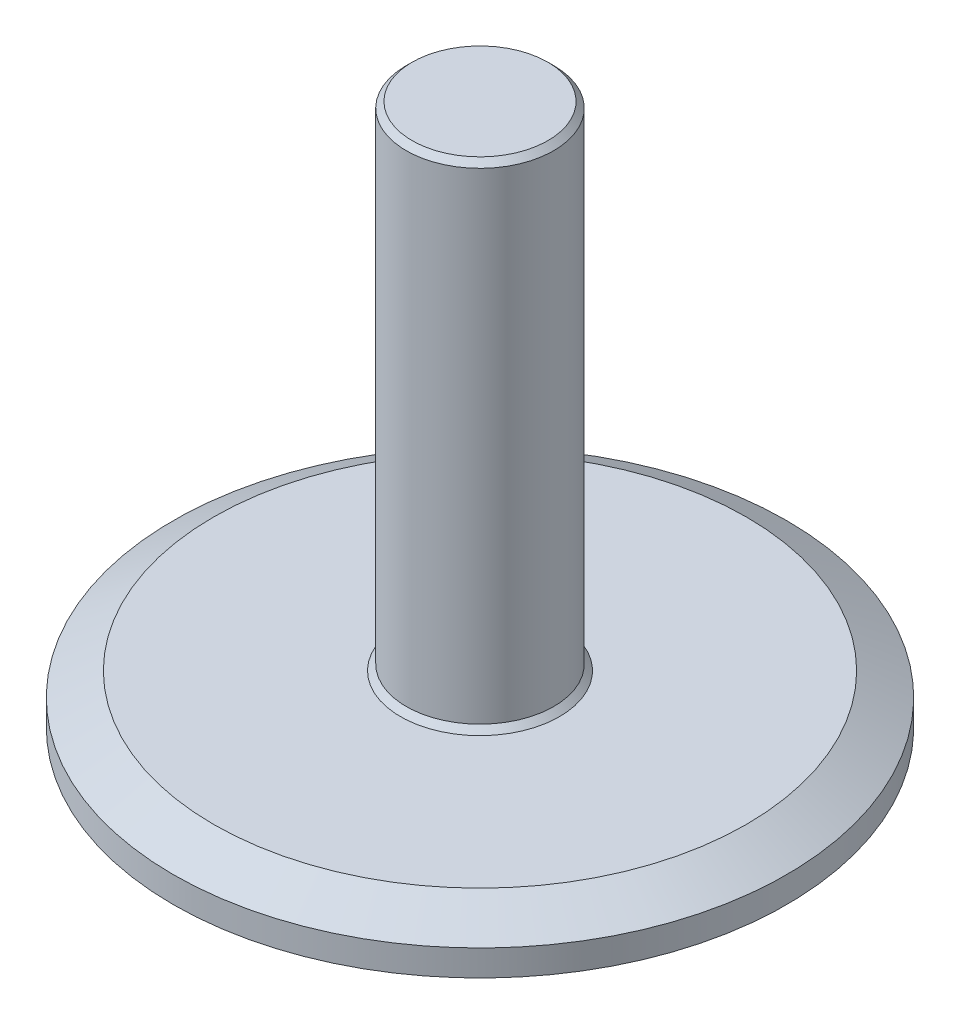
ISO-10303-21;
HEADER;
FILE_DESCRIPTION(('STEP AP214'),'2;1');
FILE_NAME('part.step','',(''),(''),'','','');
FILE_SCHEMA(('AUTOMOTIVE_DESIGN { 1 0 10303 214 1 1 1 1 }'));
ENDSEC;
DATA;
#1=APPLICATION_CONTEXT('core data for automotive mechanical design processes');
#2=APPLICATION_PROTOCOL_DEFINITION('international standard','automotive_design',2000,#1);
#3=PRODUCT_CONTEXT('',#1,'mechanical');
#4=PRODUCT('Part','Part','',(#3));
#5=PRODUCT_RELATED_PRODUCT_CATEGORY('part','',(#4));
#6=PRODUCT_DEFINITION_FORMATION('','',#4);
#7=PRODUCT_DEFINITION_CONTEXT('part definition',#1,'design');
#8=PRODUCT_DEFINITION('design','',#6,#7);
#9=PRODUCT_DEFINITION_SHAPE('','',#8);
#10=(LENGTH_UNIT() NAMED_UNIT(*) SI_UNIT(.MILLI.,.METRE.));
#11=(NAMED_UNIT(*) PLANE_ANGLE_UNIT() SI_UNIT($,.RADIAN.));
#12=(NAMED_UNIT(*) SI_UNIT($,.STERADIAN.) SOLID_ANGLE_UNIT());
#13=UNCERTAINTY_MEASURE_WITH_UNIT(LENGTH_MEASURE(1.E-05),#10,'distance_accuracy_value','');
#14=(GEOMETRIC_REPRESENTATION_CONTEXT(3) GLOBAL_UNCERTAINTY_ASSIGNED_CONTEXT((#13)) GLOBAL_UNIT_ASSIGNED_CONTEXT((#10,
#11,#12)) REPRESENTATION_CONTEXT('',''));
#15=CARTESIAN_POINT('',(0.,0.,0.));
#16=DIRECTION('',(0.,0.,1.));
#17=DIRECTION('',(1.,0.,0.));
#18=AXIS2_PLACEMENT_3D('',#15,#16,#17);
#19=CARTESIAN_POINT('',(-32.,0.,0.));
#20=DIRECTION('',(0.,1.,0.));
#21=DIRECTION('',(0.,0.,1.));
#22=AXIS2_PLACEMENT_3D('',#19,#20,#21);
#23=PLANE('',#22);
#24=CARTESIAN_POINT('',(0.,0.,0.));
#25=DIRECTION('',(0.,-1.,0.));
#26=DIRECTION('',(0.,0.,-1.));
#27=AXIS2_PLACEMENT_3D('',#24,#25,#26);
#28=CIRCLE('',#27,2.70509999999999);
#29=CARTESIAN_POINT('',(0.,0.,-2.70509999999999));
#30=VERTEX_POINT('',#29);
#31=EDGE_CURVE('E60',#30,#30,#28,.T.);
#32=ORIENTED_EDGE('',*,*,#31,.F.);
#33=EDGE_LOOP('',(#32));
#34=FACE_BOUND('',#33,.T.);
#35=CARTESIAN_POINT('',(0.,0.,0.));
#36=DIRECTION('',(0.,-1.,0.));
#37=DIRECTION('',(0.,0.,-1.));
#38=AXIS2_PLACEMENT_3D('',#35,#36,#37);
#39=CIRCLE('',#38,32.);
#40=CARTESIAN_POINT('',(0.,0.,-32.));
#41=VERTEX_POINT('',#40);
#42=EDGE_CURVE('E59',#41,#41,#39,.T.);
#43=ORIENTED_EDGE('',*,*,#42,.T.);
#44=EDGE_LOOP('',(#43));
#45=FACE_BOUND('',#44,.T.);
#46=ADVANCED_FACE('F40',(#34,#45),#23,.F.);
#47=CARTESIAN_POINT('',(0.,70.85,0.));
#48=DIRECTION('',(0.,-1.,0.));
#49=DIRECTION('',(0.,0.,-1.));
#50=AXIS2_PLACEMENT_3D('',#47,#48,#49);
#51=PLANE('',#50);
#52=CARTESIAN_POINT('',(0.,70.85,0.));
#53=DIRECTION('',(0.,-1.,0.));
#54=DIRECTION('',(0.,0.,-1.));
#55=AXIS2_PLACEMENT_3D('',#52,#53,#54);
#56=CIRCLE('',#55,8.74999999999997);
#57=CARTESIAN_POINT('',(0.,70.85,-8.74999999999997));
#58=VERTEX_POINT('',#57);
#59=EDGE_CURVE('E82',#58,#58,#56,.F.);
#60=ORIENTED_EDGE('',*,*,#59,.T.);
#61=EDGE_LOOP('',(#60));
#62=FACE_BOUND('',#61,.T.);
#63=ADVANCED_FACE('F100',(#62),#51,.F.);
#64=CARTESIAN_POINT('',(0.,0.,0.));
#65=DIRECTION('',(0.,-1.,0.));
#66=DIRECTION('',(0.,0.,-1.));
#67=AXIS2_PLACEMENT_3D('',#64,#65,#66);
#68=CYLINDRICAL_SURFACE('',#67,9.49999999999999);
#69=CARTESIAN_POINT('',(0.,8.09999999999999,0.));
#70=DIRECTION('',(0.,-1.,0.));
#71=DIRECTION('',(0.,0.,-1.));
#72=AXIS2_PLACEMENT_3D('',#69,#70,#71);
#73=CIRCLE('',#72,9.49999999999999);
#74=CARTESIAN_POINT('',(0.,8.09999999999999,-9.49999999999999));
#75=VERTEX_POINT('',#74);
#76=EDGE_CURVE('E79',#75,#75,#73,.F.);
#77=ORIENTED_EDGE('',*,*,#76,.T.);
#78=EDGE_LOOP('',(#77));
#79=FACE_BOUND('',#78,.T.);
#80=CARTESIAN_POINT('',(0.,70.1,0.));
#81=DIRECTION('',(0.,-1.,0.));
#82=DIRECTION('',(0.,0.,-1.));
#83=AXIS2_PLACEMENT_3D('',#80,#81,#82);
#84=CIRCLE('',#83,9.49999999999999);
#85=CARTESIAN_POINT('',(0.,70.1,-9.49999999999999));
#86=VERTEX_POINT('',#85);
#87=EDGE_CURVE('E76',#86,#86,#84,.T.);
#88=ORIENTED_EDGE('',*,*,#87,.T.);
#89=EDGE_LOOP('',(#88));
#90=FACE_BOUND('',#89,.T.);
#91=ADVANCED_FACE('F106',(#79,#90),#68,.T.);
#92=CARTESIAN_POINT('',(-9.49999999999999,7.35,0.));
#93=DIRECTION('',(0.,-1.,0.));
#94=DIRECTION('',(0.,0.,-1.));
#95=AXIS2_PLACEMENT_3D('',#92,#93,#94);
#96=PLANE('',#95);
#97=CARTESIAN_POINT('',(0.,7.35,0.));
#98=DIRECTION('',(0.,-1.,0.));
#99=DIRECTION('',(0.,0.,-1.));
#100=AXIS2_PLACEMENT_3D('',#97,#98,#99);
#101=CIRCLE('',#100,34.3038475772934);
#102=CARTESIAN_POINT('',(0.,7.35,-34.3038475772934));
#103=VERTEX_POINT('',#102);
#104=EDGE_CURVE('E11',#103,#103,#101,.F.);
#105=ORIENTED_EDGE('',*,*,#104,.T.);
#106=EDGE_LOOP('',(#105));
#107=FACE_BOUND('',#106,.T.);
#108=CARTESIAN_POINT('',(0.,7.35,0.));
#109=DIRECTION('',(0.,-1.,0.));
#110=DIRECTION('',(0.,0.,-1.));
#111=AXIS2_PLACEMENT_3D('',#108,#109,#110);
#112=CIRCLE('',#111,10.25);
#113=CARTESIAN_POINT('',(0.,7.35,-10.25));
#114=VERTEX_POINT('',#113);
#115=EDGE_CURVE('E73',#114,#114,#112,.T.);
#116=ORIENTED_EDGE('',*,*,#115,.T.);
#117=EDGE_LOOP('',(#116));
#118=FACE_BOUND('',#117,.T.);
#119=ADVANCED_FACE('F126',(#107,#118),#96,.F.);
#120=CARTESIAN_POINT('',(0.,0.,0.));
#121=DIRECTION('',(0.,-1.,0.));
#122=DIRECTION('',(0.,0.,-1.));
#123=AXIS2_PLACEMENT_3D('',#120,#121,#122);
#124=CYLINDRICAL_SURFACE('',#123,39.5);
#125=CARTESIAN_POINT('',(0.,4.35,0.));
#126=DIRECTION('',(0.,-1.,0.));
#127=DIRECTION('',(0.,0.,-1.));
#128=AXIS2_PLACEMENT_3D('',#125,#126,#127);
#129=CIRCLE('',#128,39.5);
#130=CARTESIAN_POINT('',(0.,4.35,-39.5));
#131=VERTEX_POINT('',#130);
#132=EDGE_CURVE('E47',#131,#131,#129,.T.);
#133=ORIENTED_EDGE('',*,*,#132,.T.);
#134=EDGE_LOOP('',(#133));
#135=FACE_BOUND('',#134,.T.);
#136=CARTESIAN_POINT('',(0.,1.,0.));
#137=DIRECTION('',(0.,-1.,0.));
#138=DIRECTION('',(0.,0.,-1.));
#139=AXIS2_PLACEMENT_3D('',#136,#137,#138);
#140=CIRCLE('',#139,39.5);
#141=CARTESIAN_POINT('',(0.,1.,-39.5));
#142=VERTEX_POINT('',#141);
#143=EDGE_CURVE('E70',#142,#142,#140,.T.);
#144=ORIENTED_EDGE('',*,*,#143,.F.);
#145=EDGE_LOOP('',(#144));
#146=FACE_BOUND('',#145,.T.);
#147=ADVANCED_FACE('F87',(#135,#146),#124,.T.);
#148=CARTESIAN_POINT('',(-39.5,1.,0.));
#149=DIRECTION('',(0.,1.,0.));
#150=DIRECTION('',(0.,0.,1.));
#151=AXIS2_PLACEMENT_3D('',#148,#149,#150);
#152=PLANE('',#151);
#153=CARTESIAN_POINT('',(0.,1.,0.));
#154=DIRECTION('',(0.,-1.,0.));
#155=DIRECTION('',(0.,0.,-1.));
#156=AXIS2_PLACEMENT_3D('',#153,#154,#155);
#157=CIRCLE('',#156,32.);
#158=CARTESIAN_POINT('',(0.,1.,-32.));
#159=VERTEX_POINT('',#158);
#160=EDGE_CURVE('E63',#159,#159,#157,.T.);
#161=ORIENTED_EDGE('',*,*,#160,.F.);
#162=EDGE_LOOP('',(#161));
#163=FACE_BOUND('',#162,.T.);
#164=ORIENTED_EDGE('',*,*,#143,.T.);
#165=EDGE_LOOP('',(#164));
#166=FACE_BOUND('',#165,.T.);
#167=ADVANCED_FACE('F119',(#163,#166),#152,.F.);
#168=CARTESIAN_POINT('',(0.,0.,0.));
#169=DIRECTION('',(0.,-1.,0.));
#170=DIRECTION('',(0.,0.,-1.));
#171=AXIS2_PLACEMENT_3D('',#168,#169,#170);
#172=CYLINDRICAL_SURFACE('',#171,32.);
#173=ORIENTED_EDGE('',*,*,#42,.F.);
#174=EDGE_LOOP('',(#173));
#175=FACE_BOUND('',#174,.T.);
#176=ORIENTED_EDGE('',*,*,#160,.T.);
#177=EDGE_LOOP('',(#176));
#178=FACE_BOUND('',#177,.T.);
#179=ADVANCED_FACE('F114',(#175,#178),#172,.T.);
#180=CARTESIAN_POINT('',(0.,7.35,0.));
#181=DIRECTION('',(0.,-1.,0.));
#182=DIRECTION('',(0.,0.,-1.));
#183=AXIS2_PLACEMENT_3D('',#180,#181,#182);
#184=CONICAL_SURFACE('',#183,10.25,0.785398163397453);
#185=ORIENTED_EDGE('',*,*,#76,.F.);
#186=EDGE_LOOP('',(#185));
#187=FACE_BOUND('',#186,.T.);
#188=ORIENTED_EDGE('',*,*,#115,.F.);
#189=EDGE_LOOP('',(#188));
#190=FACE_BOUND('',#189,.T.);
#191=ADVANCED_FACE('F96',(#187,#190),#184,.T.);
#192=CARTESIAN_POINT('',(0.,70.1,0.));
#193=DIRECTION('',(0.,-1.,0.));
#194=DIRECTION('',(0.,0.,-1.));
#195=AXIS2_PLACEMENT_3D('',#192,#193,#194);
#196=CONICAL_SURFACE('',#195,9.49999999999999,0.785398163397458);
#197=ORIENTED_EDGE('',*,*,#59,.F.);
#198=EDGE_LOOP('',(#197));
#199=FACE_BOUND('',#198,.T.);
#200=ORIENTED_EDGE('',*,*,#87,.F.);
#201=EDGE_LOOP('',(#200));
#202=FACE_BOUND('',#201,.T.);
#203=ADVANCED_FACE('F91',(#199,#202),#196,.T.);
#204=CARTESIAN_POINT('',(0.,4.35,0.));
#205=DIRECTION('',(0.,-1.,0.));
#206=DIRECTION('',(0.,0.,-1.));
#207=AXIS2_PLACEMENT_3D('',#204,#205,#206);
#208=CONICAL_SURFACE('',#207,39.5,1.0471975511966);
#209=ORIENTED_EDGE('',*,*,#104,.F.);
#210=EDGE_LOOP('',(#209));
#211=FACE_BOUND('',#210,.T.);
#212=ORIENTED_EDGE('',*,*,#132,.F.);
#213=EDGE_LOOP('',(#212));
#214=FACE_BOUND('',#213,.T.);
#215=ADVANCED_FACE('F42',(#211,#214),#208,.T.);
#216=CARTESIAN_POINT('',(0.,19.,0.));
#217=DIRECTION('',(0.,-1.,0.));
#218=DIRECTION('',(0.,0.,-1.));
#219=AXIS2_PLACEMENT_3D('',#216,#217,#218);
#220=CONICAL_SURFACE('',#219,2.7051,1.02974425867665);
#221=CARTESIAN_POINT('',(0.,20.6253880605315,0.));
#222=VERTEX_POINT('',#221);
#223=VERTEX_LOOP('',#222);
#224=FACE_BOUND('',#223,.T.);
#225=CARTESIAN_POINT('',(0.,19.,0.));
#226=DIRECTION('',(0.,-1.,0.));
#227=DIRECTION('',(0.,0.,-1.));
#228=AXIS2_PLACEMENT_3D('',#225,#226,#227);
#229=CIRCLE('',#228,2.7051);
#230=CARTESIAN_POINT('',(0.,19.,-2.7051));
#231=VERTEX_POINT('',#230);
#232=EDGE_CURVE('E57',#231,#231,#229,.T.);
#233=ORIENTED_EDGE('',*,*,#232,.T.);
#234=EDGE_LOOP('',(#233));
#235=FACE_BOUND('',#234,.T.);
#236=ADVANCED_FACE('F50',(#224,#235),#220,.F.);
#237=CARTESIAN_POINT('',(0.,0.,0.));
#238=DIRECTION('',(0.,-1.,0.));
#239=DIRECTION('',(0.,0.,-1.));
#240=AXIS2_PLACEMENT_3D('',#237,#238,#239);
#241=CYLINDRICAL_SURFACE('',#240,2.70509999999999);
#242=ORIENTED_EDGE('',*,*,#232,.F.);
#243=EDGE_LOOP('',(#242));
#244=FACE_BOUND('',#243,.T.);
#245=ORIENTED_EDGE('',*,*,#31,.T.);
#246=EDGE_LOOP('',(#245));
#247=FACE_BOUND('',#246,.T.);
#248=ADVANCED_FACE('F53',(#244,#247),#241,.F.);
#249=CLOSED_SHELL('',(#46,#63,#91,#119,#147,#167,#179,#191,#203,#215,#236,#248));
#250=MANIFOLD_SOLID_BREP('B2',#249);
#251=ADVANCED_BREP_SHAPE_REPRESENTATION('',(#18,#250),#14);
#252=SHAPE_DEFINITION_REPRESENTATION(#9,#251);
ENDSEC;
END-ISO-10303-21;
